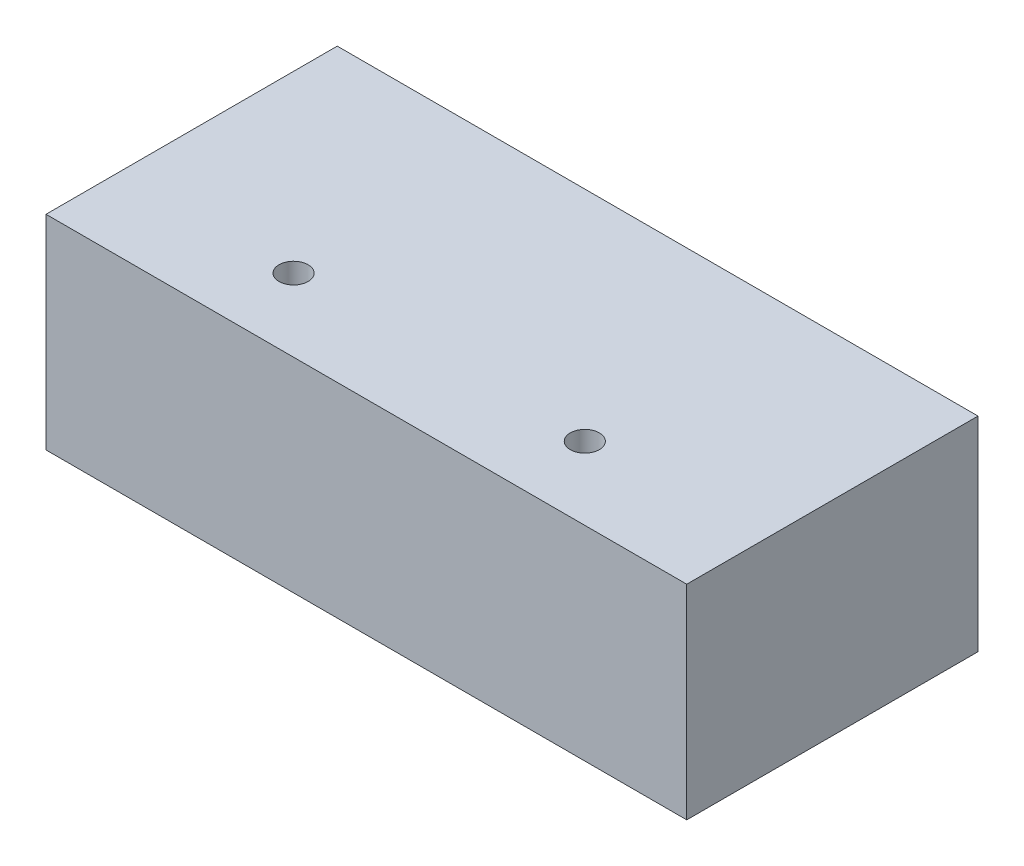
ISO-10303-21;
HEADER;
FILE_DESCRIPTION(('STEP AP214'),'2;1');
FILE_NAME('part.step','',(''),(''),'','','');
FILE_SCHEMA(('AUTOMOTIVE_DESIGN { 1 0 10303 214 1 1 1 1 }'));
ENDSEC;
DATA;
#1=APPLICATION_CONTEXT('core data for automotive mechanical design processes');
#2=APPLICATION_PROTOCOL_DEFINITION('international standard','automotive_design',2000,#1);
#3=PRODUCT_CONTEXT('',#1,'mechanical');
#4=PRODUCT('Part','Part','',(#3));
#5=PRODUCT_RELATED_PRODUCT_CATEGORY('part','',(#4));
#6=PRODUCT_DEFINITION_FORMATION('','',#4);
#7=PRODUCT_DEFINITION_CONTEXT('part definition',#1,'design');
#8=PRODUCT_DEFINITION('design','',#6,#7);
#9=PRODUCT_DEFINITION_SHAPE('','',#8);
#10=(LENGTH_UNIT() NAMED_UNIT(*) SI_UNIT(.MILLI.,.METRE.));
#11=(NAMED_UNIT(*) PLANE_ANGLE_UNIT() SI_UNIT($,.RADIAN.));
#12=(NAMED_UNIT(*) SI_UNIT($,.STERADIAN.) SOLID_ANGLE_UNIT());
#13=UNCERTAINTY_MEASURE_WITH_UNIT(LENGTH_MEASURE(1.E-05),#10,'distance_accuracy_value','');
#14=(GEOMETRIC_REPRESENTATION_CONTEXT(3) GLOBAL_UNCERTAINTY_ASSIGNED_CONTEXT((#13)) GLOBAL_UNIT_ASSIGNED_CONTEXT((#10,
#11,#12)) REPRESENTATION_CONTEXT('',''));
#15=CARTESIAN_POINT('',(0.,0.,0.));
#16=DIRECTION('',(0.,0.,1.));
#17=DIRECTION('',(1.,0.,0.));
#18=AXIS2_PLACEMENT_3D('',#15,#16,#17);
#19=CARTESIAN_POINT('',(26.4,-8.40999999999997,29.9999999999998));
#20=DIRECTION('',(-0.999999999999998,0.,0.));
#21=DIRECTION('',(0.,0.,0.999999999999999));
#22=AXIS2_PLACEMENT_3D('',#19,#20,#21);
#23=PLANE('',#22);
#24=DIRECTION('',(0.,0.,-0.999999999999999));
#25=VECTOR('',#24,1.);
#26=CARTESIAN_POINT('',(26.4,8.41000000000008,29.9999999999999));
#27=LINE('',#26,#25);
#28=CARTESIAN_POINT('',(26.4,8.41000000000008,23.9999999999999));
#29=VERTEX_POINT('',#28);
#30=CARTESIAN_POINT('',(26.3999999999999,8.41000000000003,-1.66533453693773E-13));
#31=VERTEX_POINT('',#30);
#32=EDGE_CURVE('E11',#29,#31,#27,.T.);
#33=ORIENTED_EDGE('',*,*,#32,.F.);
#34=DIRECTION('',(0.,1.,0.));
#35=VECTOR('',#34,1.);
#36=CARTESIAN_POINT('',(26.4,-8.40999999999997,24.));
#37=LINE('',#36,#35);
#38=CARTESIAN_POINT('',(26.4,-8.40999999999997,24.));
#39=VERTEX_POINT('',#38);
#40=EDGE_CURVE('E78',#39,#29,#37,.T.);
#41=ORIENTED_EDGE('',*,*,#40,.F.);
#42=DIRECTION('',(0.,0.,-0.999999999999999));
#43=VECTOR('',#42,1.);
#44=CARTESIAN_POINT('',(26.4,-8.40999999999997,29.9999999999998));
#45=LINE('',#44,#43);
#46=CARTESIAN_POINT('',(26.4,-8.41000000000003,-2.77555756156289E-13));
#47=VERTEX_POINT('',#46);
#48=EDGE_CURVE('E60',#39,#47,#45,.T.);
#49=ORIENTED_EDGE('',*,*,#48,.T.);
#50=DIRECTION('',(0.,1.,0.));
#51=VECTOR('',#50,1.);
#52=CARTESIAN_POINT('',(26.4,-8.41000000000003,-2.77555756156289E-13));
#53=LINE('',#52,#51);
#54=EDGE_CURVE('E103',#47,#31,#53,.T.);
#55=ORIENTED_EDGE('',*,*,#54,.T.);
#56=EDGE_LOOP('',(#33,#41,#49,#55));
#57=FACE_BOUND('',#56,.T.);
#58=ADVANCED_FACE('F36',(#57),#23,.F.);
#59=CARTESIAN_POINT('',(-26.3999999999999,8.41000000000003,29.9999999999999));
#60=DIRECTION('',(0.,-1.,0.));
#61=DIRECTION('',(0.,0.,-0.999999999999999));
#62=AXIS2_PLACEMENT_3D('',#59,#60,#61);
#63=PLANE('',#62);
#64=CARTESIAN_POINT('',(-11.9999999999999,8.40999999999997,17.9999999999999));
#65=DIRECTION('',(0.,1.,0.));
#66=DIRECTION('',(0.,0.,0.999999999999999));
#67=AXIS2_PLACEMENT_3D('',#64,#65,#66);
#68=CIRCLE('',#67,1.2);
#69=CARTESIAN_POINT('',(-11.9999999999999,8.40999999999997,19.1999999999999));
#70=VERTEX_POINT('',#69);
#71=EDGE_CURVE('E99',#70,#70,#68,.T.);
#72=ORIENTED_EDGE('',*,*,#71,.F.);
#73=EDGE_LOOP('',(#72));
#74=FACE_BOUND('',#73,.T.);
#75=CARTESIAN_POINT('',(12.,8.40999999999992,17.9999999999999));
#76=DIRECTION('',(0.,1.,0.));
#77=DIRECTION('',(0.,0.,0.999999999999999));
#78=AXIS2_PLACEMENT_3D('',#75,#76,#77);
#79=CIRCLE('',#78,1.2);
#80=CARTESIAN_POINT('',(12.,8.40999999999992,19.1999999999999));
#81=VERTEX_POINT('',#80);
#82=EDGE_CURVE('E105',#81,#81,#79,.T.);
#83=ORIENTED_EDGE('',*,*,#82,.F.);
#84=EDGE_LOOP('',(#83));
#85=FACE_BOUND('',#84,.T.);
#86=DIRECTION('',(0.,0.,-0.999999999999999));
#87=VECTOR('',#86,1.);
#88=CARTESIAN_POINT('',(-26.3999999999999,8.41000000000003,29.9999999999999));
#89=LINE('',#88,#87);
#90=CARTESIAN_POINT('',(-26.3999999999998,8.40999999999997,24.));
#91=VERTEX_POINT('',#90);
#92=CARTESIAN_POINT('',(-26.3999999999999,8.40999999999997,0.));
#93=VERTEX_POINT('',#92);
#94=EDGE_CURVE('E44',#91,#93,#89,.T.);
#95=ORIENTED_EDGE('',*,*,#94,.F.);
#96=DIRECTION('',(-0.999999999999998,0.,0.));
#97=VECTOR('',#96,1.);
#98=CARTESIAN_POINT('',(-26.3999999999998,8.40999999999997,24.));
#99=LINE('',#98,#97);
#100=EDGE_CURVE('E84',#29,#91,#99,.T.);
#101=ORIENTED_EDGE('',*,*,#100,.F.);
#102=ORIENTED_EDGE('',*,*,#32,.T.);
#103=DIRECTION('',(-0.999999999999998,0.,0.));
#104=VECTOR('',#103,1.);
#105=CARTESIAN_POINT('',(-26.3999999999999,8.40999999999997,0.));
#106=LINE('',#105,#104);
#107=EDGE_CURVE('E117',#31,#93,#106,.T.);
#108=ORIENTED_EDGE('',*,*,#107,.T.);
#109=EDGE_LOOP('',(#95,#101,#102,#108));
#110=FACE_BOUND('',#109,.T.);
#111=ADVANCED_FACE('F128',(#74,#85,#110),#63,.F.);
#112=CARTESIAN_POINT('',(-26.4,-8.41000000000003,30.0000000000001));
#113=DIRECTION('',(0.999999999999998,0.,0.));
#114=DIRECTION('',(0.,0.,-0.999999999999999));
#115=AXIS2_PLACEMENT_3D('',#112,#113,#114);
#116=PLANE('',#115);
#117=DIRECTION('',(0.,0.,-0.999999999999999));
#118=VECTOR('',#117,1.);
#119=CARTESIAN_POINT('',(-26.4,-8.41000000000003,30.0000000000001));
#120=LINE('',#119,#118);
#121=CARTESIAN_POINT('',(-26.4,-8.41000000000003,24.));
#122=VERTEX_POINT('',#121);
#123=CARTESIAN_POINT('',(-26.4,-8.41000000000008,0.));
#124=VERTEX_POINT('',#123);
#125=EDGE_CURVE('E90',#122,#124,#120,.T.);
#126=ORIENTED_EDGE('',*,*,#125,.F.);
#127=DIRECTION('',(0.,-1.,0.));
#128=VECTOR('',#127,1.);
#129=CARTESIAN_POINT('',(-26.4,-8.41000000000003,24.));
#130=LINE('',#129,#128);
#131=EDGE_CURVE('E52',#91,#122,#130,.T.);
#132=ORIENTED_EDGE('',*,*,#131,.F.);
#133=ORIENTED_EDGE('',*,*,#94,.T.);
#134=DIRECTION('',(0.,-1.,0.));
#135=VECTOR('',#134,1.);
#136=CARTESIAN_POINT('',(-26.4,-8.41000000000008,0.));
#137=LINE('',#136,#135);
#138=EDGE_CURVE('E93',#93,#124,#137,.T.);
#139=ORIENTED_EDGE('',*,*,#138,.T.);
#140=EDGE_LOOP('',(#126,#132,#133,#139));
#141=FACE_BOUND('',#140,.T.);
#142=ADVANCED_FACE('F122',(#141),#116,.F.);
#143=CARTESIAN_POINT('',(-26.4,-8.41000000000003,30.0000000000001));
#144=DIRECTION('',(0.,1.,0.));
#145=DIRECTION('',(0.,0.,0.999999999999999));
#146=AXIS2_PLACEMENT_3D('',#143,#144,#145);
#147=PLANE('',#146);
#148=CARTESIAN_POINT('',(-12.,-8.41000000000008,18.));
#149=DIRECTION('',(0.,1.,0.));
#150=DIRECTION('',(0.,0.,0.999999999999999));
#151=AXIS2_PLACEMENT_3D('',#148,#149,#150);
#152=CIRCLE('',#151,1.2);
#153=CARTESIAN_POINT('',(-12.,-8.41000000000008,19.2));
#154=VERTEX_POINT('',#153);
#155=EDGE_CURVE('E39',#154,#154,#152,.T.);
#156=ORIENTED_EDGE('',*,*,#155,.T.);
#157=EDGE_LOOP('',(#156));
#158=FACE_BOUND('',#157,.T.);
#159=CARTESIAN_POINT('',(12.,-8.40999999999997,17.9999999999999));
#160=DIRECTION('',(0.,1.,0.));
#161=DIRECTION('',(0.,0.,0.999999999999999));
#162=AXIS2_PLACEMENT_3D('',#159,#160,#161);
#163=CIRCLE('',#162,1.2);
#164=CARTESIAN_POINT('',(12.,-8.40999999999997,19.1999999999999));
#165=VERTEX_POINT('',#164);
#166=EDGE_CURVE('E97',#165,#165,#163,.T.);
#167=ORIENTED_EDGE('',*,*,#166,.T.);
#168=EDGE_LOOP('',(#167));
#169=FACE_BOUND('',#168,.T.);
#170=ORIENTED_EDGE('',*,*,#48,.F.);
#171=DIRECTION('',(0.999999999999998,0.,0.));
#172=VECTOR('',#171,1.);
#173=CARTESIAN_POINT('',(-26.4,-8.41000000000003,24.));
#174=LINE('',#173,#172);
#175=EDGE_CURVE('E76',#122,#39,#174,.T.);
#176=ORIENTED_EDGE('',*,*,#175,.F.);
#177=ORIENTED_EDGE('',*,*,#125,.T.);
#178=DIRECTION('',(0.999999999999998,0.,0.));
#179=VECTOR('',#178,1.);
#180=CARTESIAN_POINT('',(-26.4,-8.41000000000008,0.));
#181=LINE('',#180,#179);
#182=EDGE_CURVE('E88',#124,#47,#181,.T.);
#183=ORIENTED_EDGE('',*,*,#182,.T.);
#184=EDGE_LOOP('',(#170,#176,#177,#183));
#185=FACE_BOUND('',#184,.T.);
#186=ADVANCED_FACE('F86',(#158,#169,#185),#147,.F.);
#187=CARTESIAN_POINT('',(0.,0.,0.));
#188=DIRECTION('',(0.,0.,-0.999999999999999));
#189=DIRECTION('',(-0.999999999999998,0.,0.));
#190=AXIS2_PLACEMENT_3D('',#187,#188,#189);
#191=PLANE('',#190);
#192=CARTESIAN_POINT('',(18.6,2.77555756156289E-13,-1.11022302462516E-13));
#193=DIRECTION('',(0.,0.,0.999999999999999));
#194=DIRECTION('',(0.999999999999998,0.,0.));
#195=AXIS2_PLACEMENT_3D('',#192,#193,#194);
#196=CIRCLE('',#195,1.2);
#197=CARTESIAN_POINT('',(19.8,2.77289302630379E-13,-1.11288755988426E-13));
#198=VERTEX_POINT('',#197);
#199=EDGE_CURVE('E129',#198,#198,#196,.T.);
#200=ORIENTED_EDGE('',*,*,#199,.T.);
#201=EDGE_LOOP('',(#200));
#202=FACE_BOUND('',#201,.T.);
#203=CARTESIAN_POINT('',(-18.6,-1.11022302462516E-13,0.));
#204=DIRECTION('',(0.,0.,0.999999999999999));
#205=DIRECTION('',(0.999999999999998,0.,0.));
#206=AXIS2_PLACEMENT_3D('',#203,#204,#205);
#207=CIRCLE('',#206,1.2);
#208=CARTESIAN_POINT('',(-17.4,-1.11288755988426E-13,0.));
#209=VERTEX_POINT('',#208);
#210=EDGE_CURVE('E144',#209,#209,#207,.T.);
#211=ORIENTED_EDGE('',*,*,#210,.T.);
#212=EDGE_LOOP('',(#211));
#213=FACE_BOUND('',#212,.T.);
#214=CARTESIAN_POINT('',(-6.99999999999992,1.11022302462516E-13,-2.28983498828939E-13));
#215=DIRECTION('',(0.,0.,0.999999999999999));
#216=DIRECTION('',(0.999999999999998,0.,0.));
#217=AXIS2_PLACEMENT_3D('',#214,#215,#216);
#218=CIRCLE('',#217,1.2);
#219=CARTESIAN_POINT('',(-5.79999999999993,1.10755848936606E-13,-2.29249952354849E-13));
#220=VERTEX_POINT('',#219);
#221=EDGE_CURVE('E138',#220,#220,#218,.T.);
#222=ORIENTED_EDGE('',*,*,#221,.T.);
#223=EDGE_LOOP('',(#222));
#224=FACE_BOUND('',#223,.T.);
#225=CARTESIAN_POINT('',(6.99999999999383,3.88578058618805E-13,-1.11022302462516E-13));
#226=DIRECTION('',(0.,0.,0.999999999999999));
#227=DIRECTION('',(0.999999999999998,0.,0.));
#228=AXIS2_PLACEMENT_3D('',#225,#226,#227);
#229=CIRCLE('',#228,1.2);
#230=CARTESIAN_POINT('',(8.19999999999383,3.88311605092895E-13,-1.11288755988426E-13));
#231=VERTEX_POINT('',#230);
#232=EDGE_CURVE('E113',#231,#231,#229,.T.);
#233=ORIENTED_EDGE('',*,*,#232,.T.);
#234=EDGE_LOOP('',(#233));
#235=FACE_BOUND('',#234,.T.);
#236=ORIENTED_EDGE('',*,*,#54,.F.);
#237=ORIENTED_EDGE('',*,*,#182,.F.);
#238=ORIENTED_EDGE('',*,*,#138,.F.);
#239=ORIENTED_EDGE('',*,*,#107,.F.);
#240=EDGE_LOOP('',(#236,#237,#238,#239));
#241=FACE_BOUND('',#240,.T.);
#242=ADVANCED_FACE('F126',(#202,#213,#224,#235,#241),#191,.T.);
#243=CARTESIAN_POINT('',(12.,-11.59,17.9999999999999));
#244=DIRECTION('',(0.,1.,0.));
#245=DIRECTION('',(0.,0.,0.999999999999999));
#246=AXIS2_PLACEMENT_3D('',#243,#244,#245);
#247=CYLINDRICAL_SURFACE('',#246,1.2);
#248=ORIENTED_EDGE('',*,*,#82,.T.);
#249=EDGE_LOOP('',(#248));
#250=FACE_BOUND('',#249,.T.);
#251=ORIENTED_EDGE('',*,*,#166,.F.);
#252=EDGE_LOOP('',(#251));
#253=FACE_BOUND('',#252,.T.);
#254=ADVANCED_FACE('F167',(#250,#253),#247,.F.);
#255=CARTESIAN_POINT('',(-12.,-11.59,17.9999999999998));
#256=DIRECTION('',(0.,1.,0.));
#257=DIRECTION('',(0.,0.,0.999999999999999));
#258=AXIS2_PLACEMENT_3D('',#255,#256,#257);
#259=CYLINDRICAL_SURFACE('',#258,1.2);
#260=ORIENTED_EDGE('',*,*,#71,.T.);
#261=EDGE_LOOP('',(#260));
#262=FACE_BOUND('',#261,.T.);
#263=ORIENTED_EDGE('',*,*,#155,.F.);
#264=EDGE_LOOP('',(#263));
#265=FACE_BOUND('',#264,.T.);
#266=ADVANCED_FACE('F158',(#262,#265),#259,.F.);
#267=CARTESIAN_POINT('',(6.99999999999386,3.88578058618805E-13,10.));
#268=DIRECTION('',(0.,0.,-0.999999999999999));
#269=DIRECTION('',(-0.999999999999998,0.,0.));
#270=AXIS2_PLACEMENT_3D('',#267,#268,#269);
#271=CYLINDRICAL_SURFACE('',#270,1.2);
#272=CARTESIAN_POINT('',(6.99999999999386,3.88578058618805E-13,10.));
#273=DIRECTION('',(0.,0.,0.999999999999999));
#274=DIRECTION('',(0.999999999999998,0.,0.));
#275=AXIS2_PLACEMENT_3D('',#272,#273,#274);
#276=CIRCLE('',#275,1.2);
#277=CARTESIAN_POINT('',(8.19999999999386,3.88311605092895E-13,10.));
#278=VERTEX_POINT('',#277);
#279=EDGE_CURVE('E110',#278,#278,#276,.T.);
#280=ORIENTED_EDGE('',*,*,#279,.T.);
#281=EDGE_LOOP('',(#280));
#282=FACE_BOUND('',#281,.T.);
#283=ORIENTED_EDGE('',*,*,#232,.F.);
#284=EDGE_LOOP('',(#283));
#285=FACE_BOUND('',#284,.T.);
#286=ADVANCED_FACE('F155',(#282,#285),#271,.F.);
#287=CARTESIAN_POINT('',(6.99999999999386,3.88578058618805E-13,10.));
#288=DIRECTION('',(0.,0.,0.999999999999999));
#289=DIRECTION('',(0.999999999999998,0.,0.));
#290=AXIS2_PLACEMENT_3D('',#287,#288,#289);
#291=PLANE('',#290);
#292=ORIENTED_EDGE('',*,*,#279,.F.);
#293=EDGE_LOOP('',(#292));
#294=FACE_BOUND('',#293,.T.);
#295=ADVANCED_FACE('F157',(#294),#291,.F.);
#296=CARTESIAN_POINT('',(-6.99999999999994,0.,9.9999999999999));
#297=DIRECTION('',(0.,0.,-0.999999999999999));
#298=DIRECTION('',(-0.999999999999998,0.,0.));
#299=AXIS2_PLACEMENT_3D('',#296,#297,#298);
#300=CYLINDRICAL_SURFACE('',#299,1.2);
#301=CARTESIAN_POINT('',(-6.99999999999994,0.,9.9999999999999));
#302=DIRECTION('',(0.,0.,0.999999999999999));
#303=DIRECTION('',(0.999999999999998,0.,0.));
#304=AXIS2_PLACEMENT_3D('',#301,#302,#303);
#305=CIRCLE('',#304,1.2);
#306=CARTESIAN_POINT('',(-5.79999999999994,0.,9.9999999999999));
#307=VERTEX_POINT('',#306);
#308=EDGE_CURVE('E135',#307,#307,#305,.T.);
#309=ORIENTED_EDGE('',*,*,#308,.T.);
#310=EDGE_LOOP('',(#309));
#311=FACE_BOUND('',#310,.T.);
#312=ORIENTED_EDGE('',*,*,#221,.F.);
#313=EDGE_LOOP('',(#312));
#314=FACE_BOUND('',#313,.T.);
#315=ADVANCED_FACE('F164',(#311,#314),#300,.F.);
#316=CARTESIAN_POINT('',(-6.99999999999994,0.,9.9999999999999));
#317=DIRECTION('',(0.,0.,0.999999999999999));
#318=DIRECTION('',(0.999999999999998,0.,0.));
#319=AXIS2_PLACEMENT_3D('',#316,#317,#318);
#320=PLANE('',#319);
#321=ORIENTED_EDGE('',*,*,#308,.F.);
#322=EDGE_LOOP('',(#321));
#323=FACE_BOUND('',#322,.T.);
#324=ADVANCED_FACE('F217',(#323),#320,.F.);
#325=CARTESIAN_POINT('',(-18.5999999999999,0.,9.99999999999982));
#326=DIRECTION('',(0.,0.,-0.999999999999999));
#327=DIRECTION('',(-0.999999999999998,0.,0.));
#328=AXIS2_PLACEMENT_3D('',#325,#326,#327);
#329=CYLINDRICAL_SURFACE('',#328,1.2);
#330=CARTESIAN_POINT('',(-18.5999999999999,0.,9.99999999999982));
#331=DIRECTION('',(0.,0.,0.999999999999999));
#332=DIRECTION('',(0.999999999999998,0.,0.));
#333=AXIS2_PLACEMENT_3D('',#330,#331,#332);
#334=CIRCLE('',#333,1.2);
#335=CARTESIAN_POINT('',(-17.3999999999999,0.,9.99999999999982));
#336=VERTEX_POINT('',#335);
#337=EDGE_CURVE('E141',#336,#336,#334,.T.);
#338=ORIENTED_EDGE('',*,*,#337,.T.);
#339=EDGE_LOOP('',(#338));
#340=FACE_BOUND('',#339,.T.);
#341=ORIENTED_EDGE('',*,*,#210,.F.);
#342=EDGE_LOOP('',(#341));
#343=FACE_BOUND('',#342,.T.);
#344=ADVANCED_FACE('F227',(#340,#343),#329,.F.);
#345=CARTESIAN_POINT('',(-18.5999999999999,0.,9.99999999999982));
#346=DIRECTION('',(0.,0.,0.999999999999999));
#347=DIRECTION('',(0.999999999999998,0.,0.));
#348=AXIS2_PLACEMENT_3D('',#345,#346,#347);
#349=PLANE('',#348);
#350=ORIENTED_EDGE('',*,*,#337,.F.);
#351=EDGE_LOOP('',(#350));
#352=FACE_BOUND('',#351,.T.);
#353=ADVANCED_FACE('F237',(#352),#349,.F.);
#354=CARTESIAN_POINT('',(18.6,1.11022302462516E-13,9.99999999999983));
#355=DIRECTION('',(0.,0.,-0.999999999999999));
#356=DIRECTION('',(-0.999999999999998,0.,0.));
#357=AXIS2_PLACEMENT_3D('',#354,#355,#356);
#358=CYLINDRICAL_SURFACE('',#357,1.2);
#359=CARTESIAN_POINT('',(18.6,1.11022302462516E-13,9.99999999999983));
#360=DIRECTION('',(0.,0.,0.999999999999999));
#361=DIRECTION('',(0.999999999999998,0.,0.));
#362=AXIS2_PLACEMENT_3D('',#359,#360,#361);
#363=CIRCLE('',#362,1.2);
#364=CARTESIAN_POINT('',(19.8,1.10755848936606E-13,9.99999999999983));
#365=VERTEX_POINT('',#364);
#366=EDGE_CURVE('E132',#365,#365,#363,.T.);
#367=ORIENTED_EDGE('',*,*,#366,.T.);
#368=EDGE_LOOP('',(#367));
#369=FACE_BOUND('',#368,.T.);
#370=ORIENTED_EDGE('',*,*,#199,.F.);
#371=EDGE_LOOP('',(#370));
#372=FACE_BOUND('',#371,.T.);
#373=ADVANCED_FACE('F247',(#369,#372),#358,.F.);
#374=CARTESIAN_POINT('',(18.6,1.11022302462516E-13,9.99999999999983));
#375=DIRECTION('',(0.,0.,0.999999999999999));
#376=DIRECTION('',(0.999999999999998,0.,0.));
#377=AXIS2_PLACEMENT_3D('',#374,#375,#376);
#378=PLANE('',#377);
#379=ORIENTED_EDGE('',*,*,#366,.F.);
#380=EDGE_LOOP('',(#379));
#381=FACE_BOUND('',#380,.T.);
#382=ADVANCED_FACE('F257',(#381),#378,.F.);
#383=CARTESIAN_POINT('',(0.,0.,24.));
#384=DIRECTION('',(0.,0.,-0.999999999999999));
#385=DIRECTION('',(-0.999999999999998,0.,0.));
#386=AXIS2_PLACEMENT_3D('',#383,#384,#385);
#387=PLANE('',#386);
#388=ORIENTED_EDGE('',*,*,#131,.T.);
#389=ORIENTED_EDGE('',*,*,#175,.T.);
#390=ORIENTED_EDGE('',*,*,#40,.T.);
#391=ORIENTED_EDGE('',*,*,#100,.T.);
#392=EDGE_LOOP('',(#388,#389,#390,#391));
#393=FACE_BOUND('',#392,.T.);
#394=ADVANCED_FACE('F77',(#393),#387,.F.);
#395=CLOSED_SHELL('',(#58,#111,#142,#186,#242,#254,#266,#286,#295,#315,#324,#344,#353,#373,#382,#394));
#396=MANIFOLD_SOLID_BREP('B2',#395);
#397=ADVANCED_BREP_SHAPE_REPRESENTATION('',(#18,#396),#14);
#398=SHAPE_DEFINITION_REPRESENTATION(#9,#397);
ENDSEC;
END-ISO-10303-21;
